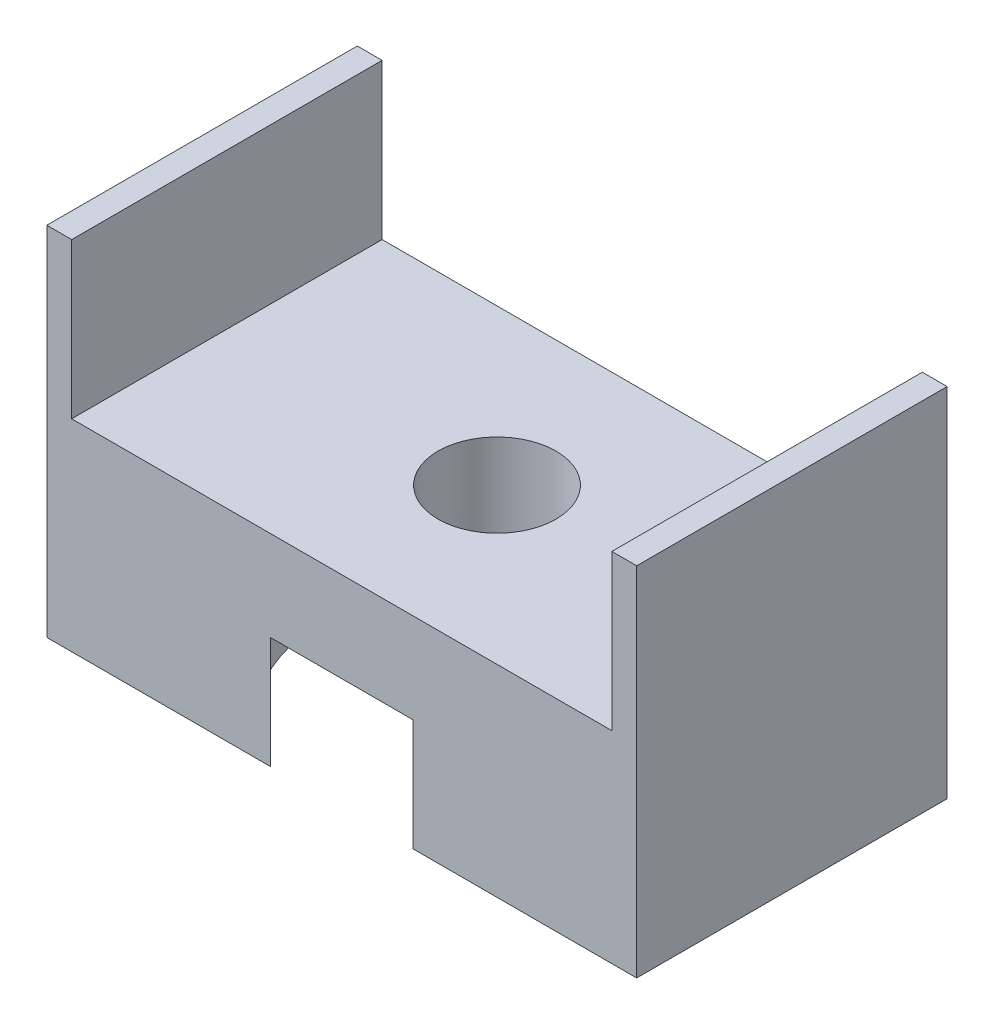
ISO-10303-21;
HEADER;
FILE_DESCRIPTION(('STEP AP214'),'2;1');
FILE_NAME('part.step','',(''),(''),'','','');
FILE_SCHEMA(('AUTOMOTIVE_DESIGN { 1 0 10303 214 1 1 1 1 }'));
ENDSEC;
DATA;
#1=APPLICATION_CONTEXT('core data for automotive mechanical design processes');
#2=APPLICATION_PROTOCOL_DEFINITION('international standard','automotive_design',2000,#1);
#3=PRODUCT_CONTEXT('',#1,'mechanical');
#4=PRODUCT('Part','Part','',(#3));
#5=PRODUCT_RELATED_PRODUCT_CATEGORY('part','',(#4));
#6=PRODUCT_DEFINITION_FORMATION('','',#4);
#7=PRODUCT_DEFINITION_CONTEXT('part definition',#1,'design');
#8=PRODUCT_DEFINITION('design','',#6,#7);
#9=PRODUCT_DEFINITION_SHAPE('','',#8);
#10=(LENGTH_UNIT() NAMED_UNIT(*) SI_UNIT(.MILLI.,.METRE.));
#11=(NAMED_UNIT(*) PLANE_ANGLE_UNIT() SI_UNIT($,.RADIAN.));
#12=(NAMED_UNIT(*) SI_UNIT($,.STERADIAN.) SOLID_ANGLE_UNIT());
#13=UNCERTAINTY_MEASURE_WITH_UNIT(LENGTH_MEASURE(1.E-05),#10,'distance_accuracy_value','');
#14=(GEOMETRIC_REPRESENTATION_CONTEXT(3) GLOBAL_UNCERTAINTY_ASSIGNED_CONTEXT((#13)) GLOBAL_UNIT_ASSIGNED_CONTEXT((#10,
#11,#12)) REPRESENTATION_CONTEXT('',''));
#15=CARTESIAN_POINT('',(0.,0.,0.));
#16=DIRECTION('',(0.,0.,1.));
#17=DIRECTION('',(1.,0.,0.));
#18=AXIS2_PLACEMENT_3D('',#15,#16,#17);
#19=CARTESIAN_POINT('',(0.,8.255,0.));
#20=DIRECTION('',(0.,-1.,0.));
#21=DIRECTION('',(0.,0.,-1.));
#22=AXIS2_PLACEMENT_3D('',#19,#20,#21);
#23=PLANE('',#22);
#24=CARTESIAN_POINT('',(12.2239273743017,8.255,-7.71507262569832));
#25=DIRECTION('',(0.,1.,0.));
#26=DIRECTION('',(0.,0.,1.));
#27=AXIS2_PLACEMENT_3D('',#24,#25,#26);
#28=CIRCLE('',#27,2.413);
#29=CARTESIAN_POINT('',(12.2239273743017,8.255,-5.30207262569832));
#30=VERTEX_POINT('',#29);
#31=EDGE_CURVE('E200',#30,#30,#28,.T.);
#32=ORIENTED_EDGE('',*,*,#31,.F.);
#33=EDGE_LOOP('',(#32));
#34=FACE_BOUND('',#33,.T.);
#35=DIRECTION('',(0.,0.,1.));
#36=VECTOR('',#35,1.);
#37=CARTESIAN_POINT('',(23.2729273743017,8.255,-14.0650726256983));
#38=LINE('',#37,#36);
#39=CARTESIAN_POINT('',(23.2729273743017,8.255,-14.0650726256983));
#40=VERTEX_POINT('',#39);
#41=CARTESIAN_POINT('',(23.2729273743017,8.255,-1.36507262569832));
#42=VERTEX_POINT('',#41);
#43=EDGE_CURVE('E154',#40,#42,#38,.T.);
#44=ORIENTED_EDGE('',*,*,#43,.F.);
#45=DIRECTION('',(-1.,0.,0.));
#46=VECTOR('',#45,1.);
#47=CARTESIAN_POINT('',(0.158927374301672,8.255,-14.0650726256983));
#48=LINE('',#47,#46);
#49=CARTESIAN_POINT('',(1.17492737430167,8.255,-14.0650726256983));
#50=VERTEX_POINT('',#49);
#51=EDGE_CURVE('E205',#40,#50,#48,.T.);
#52=ORIENTED_EDGE('',*,*,#51,.T.);
#53=DIRECTION('',(0.,0.,-1.));
#54=VECTOR('',#53,1.);
#55=CARTESIAN_POINT('',(1.17492737430167,8.255,-14.0650726256983));
#56=LINE('',#55,#54);
#57=CARTESIAN_POINT('',(1.17492737430167,8.255,-1.36507262569832));
#58=VERTEX_POINT('',#57);
#59=EDGE_CURVE('E181',#58,#50,#56,.T.);
#60=ORIENTED_EDGE('',*,*,#59,.F.);
#61=DIRECTION('',(1.,0.,0.));
#62=VECTOR('',#61,1.);
#63=CARTESIAN_POINT('',(0.158927374301672,8.255,-1.36507262569832));
#64=LINE('',#63,#62);
#65=EDGE_CURVE('E51',#58,#42,#64,.T.);
#66=ORIENTED_EDGE('',*,*,#65,.T.);
#67=EDGE_LOOP('',(#44,#52,#60,#66));
#68=FACE_BOUND('',#67,.T.);
#69=ADVANCED_FACE('F36',(#34,#68),#23,.F.);
#70=CARTESIAN_POINT('',(0.,0.,0.));
#71=DIRECTION('',(0.,-1.,0.));
#72=DIRECTION('',(0.,0.,-1.));
#73=AXIS2_PLACEMENT_3D('',#70,#71,#72);
#74=PLANE('',#73);
#75=CARTESIAN_POINT('',(12.2239273743017,0.,-7.71507262569832));
#76=DIRECTION('',(0.,-1.,0.));
#77=DIRECTION('',(0.,0.,-1.));
#78=AXIS2_PLACEMENT_3D('',#75,#76,#77);
#79=CIRCLE('',#78,6.985);
#80=CARTESIAN_POINT('',(15.1338629405986,0.,-14.0650726256983));
#81=VERTEX_POINT('',#80);
#82=CARTESIAN_POINT('',(15.1338629405986,0.,-1.36507262569832));
#83=VERTEX_POINT('',#82);
#84=EDGE_CURVE('E169',#81,#83,#79,.T.);
#85=ORIENTED_EDGE('',*,*,#84,.F.);
#86=DIRECTION('',(-1.,0.,0.));
#87=VECTOR('',#86,1.);
#88=CARTESIAN_POINT('',(0.158927374301672,0.,-14.0650726256983));
#89=LINE('',#88,#87);
#90=CARTESIAN_POINT('',(24.2889273743017,0.,-14.0650726256983));
#91=VERTEX_POINT('',#90);
#92=EDGE_CURVE('E206',#91,#81,#89,.T.);
#93=ORIENTED_EDGE('',*,*,#92,.F.);
#94=DIRECTION('',(0.,0.,-1.));
#95=VECTOR('',#94,1.);
#96=CARTESIAN_POINT('',(24.2889273743017,0.,-1.36507262569832));
#97=LINE('',#96,#95);
#98=CARTESIAN_POINT('',(24.2889273743017,0.,-1.36507262569832));
#99=VERTEX_POINT('',#98);
#100=EDGE_CURVE('E133',#99,#91,#97,.T.);
#101=ORIENTED_EDGE('',*,*,#100,.F.);
#102=DIRECTION('',(1.,0.,0.));
#103=VECTOR('',#102,1.);
#104=CARTESIAN_POINT('',(0.158927374301672,0.,-1.36507262569832));
#105=LINE('',#104,#103);
#106=EDGE_CURVE('E210',#83,#99,#105,.T.);
#107=ORIENTED_EDGE('',*,*,#106,.F.);
#108=EDGE_LOOP('',(#85,#93,#101,#107));
#109=FACE_BOUND('',#108,.T.);
#110=ADVANCED_FACE('F231',(#109),#74,.T.);
#111=CARTESIAN_POINT('',(12.2239273743017,8.255,-7.71507262569832));
#112=DIRECTION('',(0.,-1.,0.));
#113=DIRECTION('',(0.,0.,-1.));
#114=AXIS2_PLACEMENT_3D('',#111,#112,#113);
#115=CYLINDRICAL_SURFACE('',#114,2.413);
#116=ORIENTED_EDGE('',*,*,#31,.T.);
#117=EDGE_LOOP('',(#116));
#118=FACE_BOUND('',#117,.T.);
#119=CARTESIAN_POINT('',(12.2239273743017,4.572,-7.71507262569832));
#120=DIRECTION('',(0.,-1.,0.));
#121=DIRECTION('',(0.,0.,-1.));
#122=AXIS2_PLACEMENT_3D('',#119,#120,#121);
#123=CIRCLE('',#122,2.413);
#124=CARTESIAN_POINT('',(12.2239273743017,4.572,-10.1280726256983));
#125=VERTEX_POINT('',#124);
#126=EDGE_CURVE('E168',#125,#125,#123,.T.);
#127=ORIENTED_EDGE('',*,*,#126,.T.);
#128=EDGE_LOOP('',(#127));
#129=FACE_BOUND('',#128,.T.);
#130=ADVANCED_FACE('F272',(#118,#129),#115,.F.);
#131=CARTESIAN_POINT('',(9.31399180800471,0.,-1.36507262569832));
#132=VERTEX_POINT('',#131);
#133=CARTESIAN_POINT('',(9.31399180800471,0.,-14.0650726256983));
#134=VERTEX_POINT('',#133);
#135=EDGE_CURVE('E164',#132,#134,#79,.T.);
#136=ORIENTED_EDGE('',*,*,#135,.F.);
#137=CARTESIAN_POINT('',(0.158927374301672,0.,-1.36507262569832));
#138=VERTEX_POINT('',#137);
#139=EDGE_CURVE('E211',#138,#132,#105,.T.);
#140=ORIENTED_EDGE('',*,*,#139,.F.);
#141=DIRECTION('',(0.,0.,1.));
#142=VECTOR('',#141,1.);
#143=CARTESIAN_POINT('',(0.158927374301672,0.,-1.36507262569832));
#144=LINE('',#143,#142);
#145=CARTESIAN_POINT('',(0.158927374301672,0.,-14.0650726256983));
#146=VERTEX_POINT('',#145);
#147=EDGE_CURVE('E203',#146,#138,#144,.T.);
#148=ORIENTED_EDGE('',*,*,#147,.F.);
#149=EDGE_CURVE('E215',#134,#146,#89,.T.);
#150=ORIENTED_EDGE('',*,*,#149,.F.);
#151=EDGE_LOOP('',(#136,#140,#148,#150));
#152=FACE_BOUND('',#151,.T.);
#153=ADVANCED_FACE('F242',(#152),#74,.T.);
#154=CARTESIAN_POINT('',(0.158927374301672,8.255,-1.36507262569832));
#155=DIRECTION('',(1.,0.,0.));
#156=DIRECTION('',(0.,0.,-1.));
#157=AXIS2_PLACEMENT_3D('',#154,#155,#156);
#158=PLANE('',#157);
#159=ORIENTED_EDGE('',*,*,#147,.T.);
#160=DIRECTION('',(0.,-1.,0.));
#161=VECTOR('',#160,1.);
#162=CARTESIAN_POINT('',(0.158927374301672,8.255,-1.36507262569832));
#163=LINE('',#162,#161);
#164=CARTESIAN_POINT('',(0.158927374301674,14.605,-1.36507262569832));
#165=VERTEX_POINT('',#164);
#166=EDGE_CURVE('E220',#165,#138,#163,.T.);
#167=ORIENTED_EDGE('',*,*,#166,.F.);
#168=DIRECTION('',(0.,0.,1.));
#169=VECTOR('',#168,1.);
#170=CARTESIAN_POINT('',(0.158927374301672,14.605,-14.0650726256983));
#171=LINE('',#170,#169);
#172=CARTESIAN_POINT('',(0.158927374301672,14.605,-14.0650726256983));
#173=VERTEX_POINT('',#172);
#174=EDGE_CURVE('E182',#173,#165,#171,.T.);
#175=ORIENTED_EDGE('',*,*,#174,.F.);
#176=DIRECTION('',(0.,-1.,0.));
#177=VECTOR('',#176,1.);
#178=CARTESIAN_POINT('',(0.158927374301672,8.255,-14.0650726256983));
#179=LINE('',#178,#177);
#180=EDGE_CURVE('E138',#173,#146,#179,.T.);
#181=ORIENTED_EDGE('',*,*,#180,.T.);
#182=EDGE_LOOP('',(#159,#167,#175,#181));
#183=FACE_BOUND('',#182,.T.);
#184=ADVANCED_FACE('F38',(#183),#158,.F.);
#185=CARTESIAN_POINT('',(0.158927374301672,8.255,-1.36507262569832));
#186=DIRECTION('',(0.,0.,-1.));
#187=DIRECTION('',(-1.,0.,0.));
#188=AXIS2_PLACEMENT_3D('',#185,#186,#187);
#189=PLANE('',#188);
#190=DIRECTION('',(-1.,0.,0.));
#191=VECTOR('',#190,1.);
#192=CARTESIAN_POINT('',(0.158927374301672,4.572,-1.36507262569832));
#193=LINE('',#192,#191);
#194=CARTESIAN_POINT('',(15.1338629405986,4.572,-1.36507262569832));
#195=VERTEX_POINT('',#194);
#196=CARTESIAN_POINT('',(9.31399180800471,4.572,-1.36507262569832));
#197=VERTEX_POINT('',#196);
#198=EDGE_CURVE('E173',#195,#197,#193,.T.);
#199=ORIENTED_EDGE('',*,*,#198,.F.);
#200=DIRECTION('',(0.,-1.,0.));
#201=VECTOR('',#200,1.);
#202=CARTESIAN_POINT('',(15.1338629405986,4.572,-1.36507262569832));
#203=LINE('',#202,#201);
#204=EDGE_CURVE('E178',#195,#83,#203,.T.);
#205=ORIENTED_EDGE('',*,*,#204,.T.);
#206=ORIENTED_EDGE('',*,*,#106,.T.);
#207=DIRECTION('',(0.,-1.,0.));
#208=VECTOR('',#207,1.);
#209=CARTESIAN_POINT('',(24.2889273743017,8.255,-1.36507262569832));
#210=LINE('',#209,#208);
#211=CARTESIAN_POINT('',(24.2889273743017,14.605,-1.36507262569833));
#212=VERTEX_POINT('',#211);
#213=EDGE_CURVE('E137',#212,#99,#210,.T.);
#214=ORIENTED_EDGE('',*,*,#213,.F.);
#215=DIRECTION('',(1.,0.,0.));
#216=VECTOR('',#215,1.);
#217=CARTESIAN_POINT('',(24.2889273743017,14.605,-1.36507262569833));
#218=LINE('',#217,#216);
#219=CARTESIAN_POINT('',(23.2729273743017,14.605,-1.36507262569832));
#220=VERTEX_POINT('',#219);
#221=EDGE_CURVE('E153',#220,#212,#218,.T.);
#222=ORIENTED_EDGE('',*,*,#221,.F.);
#223=DIRECTION('',(0.,-1.,0.));
#224=VECTOR('',#223,1.);
#225=CARTESIAN_POINT('',(23.2729273743017,14.605,-1.36507262569832));
#226=LINE('',#225,#224);
#227=EDGE_CURVE('E159',#220,#42,#226,.T.);
#228=ORIENTED_EDGE('',*,*,#227,.T.);
#229=ORIENTED_EDGE('',*,*,#65,.F.);
#230=DIRECTION('',(0.,-1.,0.));
#231=VECTOR('',#230,1.);
#232=CARTESIAN_POINT('',(1.17492737430167,14.605,-1.36507262569832));
#233=LINE('',#232,#231);
#234=CARTESIAN_POINT('',(1.17492737430167,14.605,-1.36507262569832));
#235=VERTEX_POINT('',#234);
#236=EDGE_CURVE('E197',#235,#58,#233,.T.);
#237=ORIENTED_EDGE('',*,*,#236,.F.);
#238=DIRECTION('',(1.,0.,0.));
#239=VECTOR('',#238,1.);
#240=CARTESIAN_POINT('',(0.158927374301674,14.605,-1.36507262569832));
#241=LINE('',#240,#239);
#242=EDGE_CURVE('E185',#165,#235,#241,.T.);
#243=ORIENTED_EDGE('',*,*,#242,.F.);
#244=ORIENTED_EDGE('',*,*,#166,.T.);
#245=ORIENTED_EDGE('',*,*,#139,.T.);
#246=DIRECTION('',(0.,-1.,0.));
#247=VECTOR('',#246,1.);
#248=CARTESIAN_POINT('',(9.31399180800471,4.572,-1.36507262569832));
#249=LINE('',#248,#247);
#250=EDGE_CURVE('E175',#132,#197,#249,.F.);
#251=ORIENTED_EDGE('',*,*,#250,.T.);
#252=EDGE_LOOP('',(#199,#205,#206,#214,#222,#228,#229,#237,#243,#244,#245,#251));
#253=FACE_BOUND('',#252,.T.);
#254=ADVANCED_FACE('F234',(#253),#189,.F.);
#255=CARTESIAN_POINT('',(24.2889273743017,8.255,-1.36507262569832));
#256=DIRECTION('',(-1.,0.,0.));
#257=DIRECTION('',(0.,0.,1.));
#258=AXIS2_PLACEMENT_3D('',#255,#256,#257);
#259=PLANE('',#258);
#260=ORIENTED_EDGE('',*,*,#100,.T.);
#261=DIRECTION('',(0.,-1.,0.));
#262=VECTOR('',#261,1.);
#263=CARTESIAN_POINT('',(24.2889273743017,8.255,-14.0650726256983));
#264=LINE('',#263,#262);
#265=CARTESIAN_POINT('',(24.2889273743017,14.605,-14.0650726256983));
#266=VERTEX_POINT('',#265);
#267=EDGE_CURVE('E126',#266,#91,#264,.T.);
#268=ORIENTED_EDGE('',*,*,#267,.F.);
#269=DIRECTION('',(0.,0.,-1.));
#270=VECTOR('',#269,1.);
#271=CARTESIAN_POINT('',(24.2889273743017,14.605,-14.0650726256983));
#272=LINE('',#271,#270);
#273=EDGE_CURVE('E131',#212,#266,#272,.T.);
#274=ORIENTED_EDGE('',*,*,#273,.F.);
#275=ORIENTED_EDGE('',*,*,#213,.T.);
#276=EDGE_LOOP('',(#260,#268,#274,#275));
#277=FACE_BOUND('',#276,.T.);
#278=ADVANCED_FACE('F128',(#277),#259,.F.);
#279=CARTESIAN_POINT('',(0.158927374301672,8.255,-14.0650726256983));
#280=DIRECTION('',(0.,0.,1.));
#281=DIRECTION('',(1.,0.,0.));
#282=AXIS2_PLACEMENT_3D('',#279,#280,#281);
#283=PLANE('',#282);
#284=DIRECTION('',(1.,0.,0.));
#285=VECTOR('',#284,1.);
#286=CARTESIAN_POINT('',(0.158927374301672,4.572,-14.0650726256983));
#287=LINE('',#286,#285);
#288=CARTESIAN_POINT('',(9.31399180800471,4.572,-14.0650726256983));
#289=VERTEX_POINT('',#288);
#290=CARTESIAN_POINT('',(15.1338629405986,4.572,-14.0650726256983));
#291=VERTEX_POINT('',#290);
#292=EDGE_CURVE('E171',#289,#291,#287,.T.);
#293=ORIENTED_EDGE('',*,*,#292,.F.);
#294=DIRECTION('',(0.,-1.,0.));
#295=VECTOR('',#294,1.);
#296=CARTESIAN_POINT('',(9.31399180800471,4.572,-14.0650726256983));
#297=LINE('',#296,#295);
#298=EDGE_CURVE('E11',#289,#134,#297,.T.);
#299=ORIENTED_EDGE('',*,*,#298,.T.);
#300=ORIENTED_EDGE('',*,*,#149,.T.);
#301=ORIENTED_EDGE('',*,*,#180,.F.);
#302=DIRECTION('',(-1.,0.,0.));
#303=VECTOR('',#302,1.);
#304=CARTESIAN_POINT('',(0.158927374301672,14.605,-14.0650726256983));
#305=LINE('',#304,#303);
#306=CARTESIAN_POINT('',(1.17492737430167,14.605,-14.0650726256983));
#307=VERTEX_POINT('',#306);
#308=EDGE_CURVE('E189',#307,#173,#305,.T.);
#309=ORIENTED_EDGE('',*,*,#308,.F.);
#310=DIRECTION('',(0.,-1.,0.));
#311=VECTOR('',#310,1.);
#312=CARTESIAN_POINT('',(1.17492737430167,14.605,-14.0650726256983));
#313=LINE('',#312,#311);
#314=EDGE_CURVE('E192',#307,#50,#313,.T.);
#315=ORIENTED_EDGE('',*,*,#314,.T.);
#316=ORIENTED_EDGE('',*,*,#51,.F.);
#317=DIRECTION('',(0.,-1.,0.));
#318=VECTOR('',#317,1.);
#319=CARTESIAN_POINT('',(23.2729273743017,14.605,-14.0650726256983));
#320=LINE('',#319,#318);
#321=CARTESIAN_POINT('',(23.2729273743017,14.605,-14.0650726256983));
#322=VERTEX_POINT('',#321);
#323=EDGE_CURVE('E145',#322,#40,#320,.T.);
#324=ORIENTED_EDGE('',*,*,#323,.F.);
#325=DIRECTION('',(-1.,0.,0.));
#326=VECTOR('',#325,1.);
#327=CARTESIAN_POINT('',(24.2889273743017,14.605,-14.0650726256983));
#328=LINE('',#327,#326);
#329=EDGE_CURVE('E141',#266,#322,#328,.T.);
#330=ORIENTED_EDGE('',*,*,#329,.F.);
#331=ORIENTED_EDGE('',*,*,#267,.T.);
#332=ORIENTED_EDGE('',*,*,#92,.T.);
#333=DIRECTION('',(0.,-1.,0.));
#334=VECTOR('',#333,1.);
#335=CARTESIAN_POINT('',(15.1338629405986,4.572,-14.0650726256983));
#336=LINE('',#335,#334);
#337=EDGE_CURVE('E44',#81,#291,#336,.F.);
#338=ORIENTED_EDGE('',*,*,#337,.T.);
#339=EDGE_LOOP('',(#293,#299,#300,#301,#309,#315,#316,#324,#330,#331,#332,#338));
#340=FACE_BOUND('',#339,.T.);
#341=ADVANCED_FACE('F143',(#340),#283,.F.);
#342=CARTESIAN_POINT('',(1.17492737430167,14.605,-14.0650726256983));
#343=DIRECTION('',(-1.,0.,0.));
#344=DIRECTION('',(0.,0.,1.));
#345=AXIS2_PLACEMENT_3D('',#342,#343,#344);
#346=PLANE('',#345);
#347=ORIENTED_EDGE('',*,*,#59,.T.);
#348=ORIENTED_EDGE('',*,*,#314,.F.);
#349=DIRECTION('',(0.,0.,-1.));
#350=VECTOR('',#349,1.);
#351=CARTESIAN_POINT('',(1.17492737430167,14.605,-14.0650726256983));
#352=LINE('',#351,#350);
#353=EDGE_CURVE('E187',#235,#307,#352,.T.);
#354=ORIENTED_EDGE('',*,*,#353,.F.);
#355=ORIENTED_EDGE('',*,*,#236,.T.);
#356=EDGE_LOOP('',(#347,#348,#354,#355));
#357=FACE_BOUND('',#356,.T.);
#358=ADVANCED_FACE('F253',(#357),#346,.F.);
#359=CARTESIAN_POINT('',(0.,14.605,0.));
#360=DIRECTION('',(0.,1.,0.));
#361=DIRECTION('',(0.,0.,1.));
#362=AXIS2_PLACEMENT_3D('',#359,#360,#361);
#363=PLANE('',#362);
#364=ORIENTED_EDGE('',*,*,#174,.T.);
#365=ORIENTED_EDGE('',*,*,#242,.T.);
#366=ORIENTED_EDGE('',*,*,#353,.T.);
#367=ORIENTED_EDGE('',*,*,#308,.T.);
#368=EDGE_LOOP('',(#364,#365,#366,#367));
#369=FACE_BOUND('',#368,.T.);
#370=ADVANCED_FACE('F248',(#369),#363,.T.);
#371=CARTESIAN_POINT('',(12.2239273743017,4.572,-7.71507262569832));
#372=DIRECTION('',(0.,-1.,0.));
#373=DIRECTION('',(0.,0.,-1.));
#374=AXIS2_PLACEMENT_3D('',#371,#372,#373);
#375=CYLINDRICAL_SURFACE('',#374,6.985);
#376=CARTESIAN_POINT('',(12.2239273743017,4.572,-7.71507262569832));
#377=DIRECTION('',(0.,-1.,0.));
#378=DIRECTION('',(0.,0.,-1.));
#379=AXIS2_PLACEMENT_3D('',#376,#377,#378);
#380=CIRCLE('',#379,6.985);
#381=EDGE_CURVE('E165',#291,#195,#380,.T.);
#382=ORIENTED_EDGE('',*,*,#381,.F.);
#383=ORIENTED_EDGE('',*,*,#337,.F.);
#384=ORIENTED_EDGE('',*,*,#84,.T.);
#385=ORIENTED_EDGE('',*,*,#204,.F.);
#386=EDGE_LOOP('',(#382,#383,#384,#385));
#387=FACE_BOUND('',#386,.T.);
#388=ADVANCED_FACE('F228',(#387),#375,.F.);
#389=ORIENTED_EDGE('',*,*,#135,.T.);
#390=ORIENTED_EDGE('',*,*,#298,.F.);
#391=EDGE_CURVE('E59',#197,#289,#380,.T.);
#392=ORIENTED_EDGE('',*,*,#391,.F.);
#393=ORIENTED_EDGE('',*,*,#250,.F.);
#394=EDGE_LOOP('',(#389,#390,#392,#393));
#395=FACE_BOUND('',#394,.T.);
#396=ADVANCED_FACE('F237',(#395),#375,.F.);
#397=CARTESIAN_POINT('',(12.2239273743017,4.572,-7.71507262569832));
#398=DIRECTION('',(0.,-1.,0.));
#399=DIRECTION('',(0.,0.,-1.));
#400=AXIS2_PLACEMENT_3D('',#397,#398,#399);
#401=PLANE('',#400);
#402=ORIENTED_EDGE('',*,*,#126,.F.);
#403=EDGE_LOOP('',(#402));
#404=FACE_BOUND('',#403,.T.);
#405=ORIENTED_EDGE('',*,*,#198,.T.);
#406=ORIENTED_EDGE('',*,*,#391,.T.);
#407=ORIENTED_EDGE('',*,*,#292,.T.);
#408=ORIENTED_EDGE('',*,*,#381,.T.);
#409=EDGE_LOOP('',(#405,#406,#407,#408));
#410=FACE_BOUND('',#409,.T.);
#411=ADVANCED_FACE('F235',(#404,#410),#401,.T.);
#412=CARTESIAN_POINT('',(23.2729273743017,14.605,-14.0650726256983));
#413=DIRECTION('',(1.,0.,0.));
#414=DIRECTION('',(0.,0.,-1.));
#415=AXIS2_PLACEMENT_3D('',#412,#413,#414);
#416=PLANE('',#415);
#417=ORIENTED_EDGE('',*,*,#43,.T.);
#418=ORIENTED_EDGE('',*,*,#227,.F.);
#419=DIRECTION('',(0.,0.,1.));
#420=VECTOR('',#419,1.);
#421=CARTESIAN_POINT('',(23.2729273743017,14.605,-14.0650726256983));
#422=LINE('',#421,#420);
#423=EDGE_CURVE('E148',#322,#220,#422,.T.);
#424=ORIENTED_EDGE('',*,*,#423,.F.);
#425=ORIENTED_EDGE('',*,*,#323,.T.);
#426=EDGE_LOOP('',(#417,#418,#424,#425));
#427=FACE_BOUND('',#426,.T.);
#428=ADVANCED_FACE('F256',(#427),#416,.F.);
#429=CARTESIAN_POINT('',(0.,14.605,0.));
#430=DIRECTION('',(0.,-1.,0.));
#431=DIRECTION('',(0.,0.,-1.));
#432=AXIS2_PLACEMENT_3D('',#429,#430,#431);
#433=PLANE('',#432);
#434=ORIENTED_EDGE('',*,*,#273,.T.);
#435=ORIENTED_EDGE('',*,*,#329,.T.);
#436=ORIENTED_EDGE('',*,*,#423,.T.);
#437=ORIENTED_EDGE('',*,*,#221,.T.);
#438=EDGE_LOOP('',(#434,#435,#436,#437));
#439=FACE_BOUND('',#438,.T.);
#440=ADVANCED_FACE('F151',(#439),#433,.F.);
#441=CLOSED_SHELL('',(#69,#110,#130,#153,#184,#254,#278,#341,#358,#370,#388,#396,#411,#428,#440));
#442=MANIFOLD_SOLID_BREP('B2',#441);
#443=ADVANCED_BREP_SHAPE_REPRESENTATION('',(#18,#442),#14);
#444=SHAPE_DEFINITION_REPRESENTATION(#9,#443);
ENDSEC;
END-ISO-10303-21;
